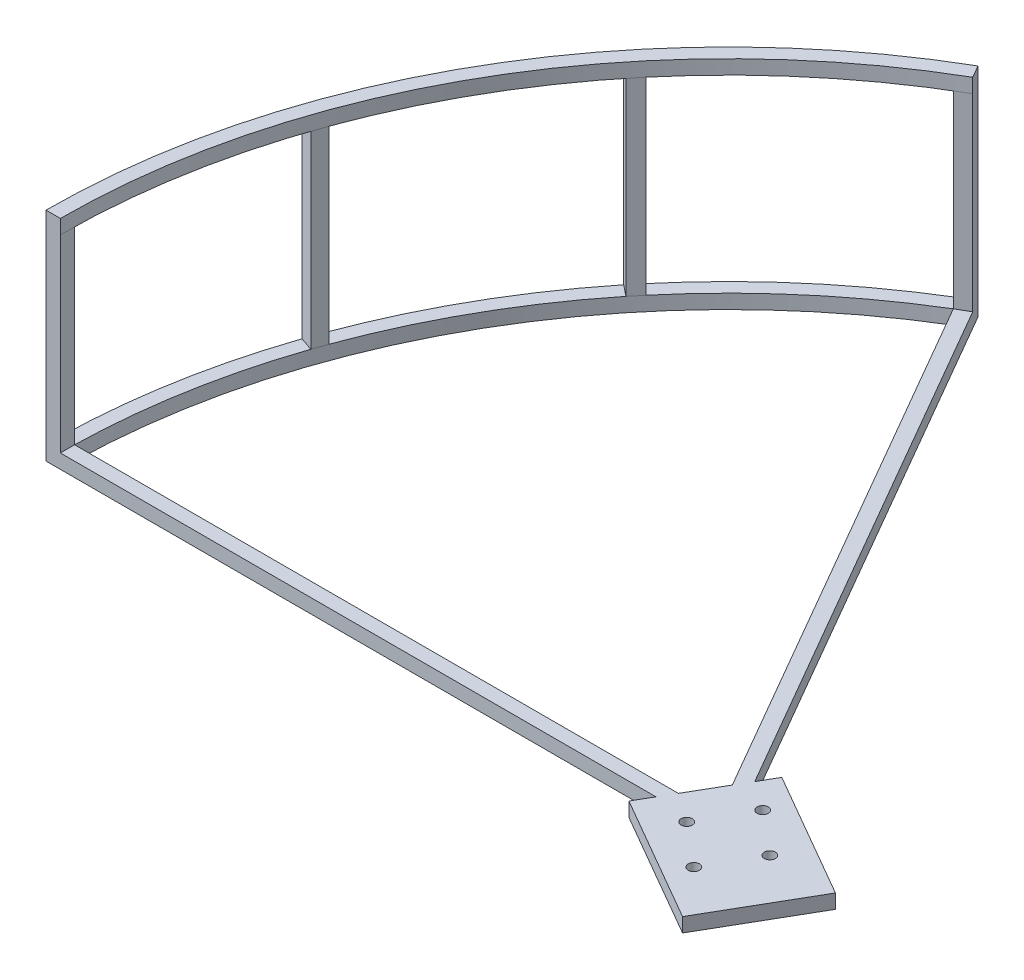
ISO-10303-21;
HEADER;
FILE_DESCRIPTION(('STEP AP214'),'2;1');
FILE_NAME('part.step','',(''),(''),'','','');
FILE_SCHEMA(('AUTOMOTIVE_DESIGN { 1 0 10303 214 1 1 1 1 }'));
ENDSEC;
DATA;
#1=APPLICATION_CONTEXT('core data for automotive mechanical design processes');
#2=APPLICATION_PROTOCOL_DEFINITION('international standard','automotive_design',2000,#1);
#3=PRODUCT_CONTEXT('',#1,'mechanical');
#4=PRODUCT('Part','Part','',(#3));
#5=PRODUCT_RELATED_PRODUCT_CATEGORY('part','',(#4));
#6=PRODUCT_DEFINITION_FORMATION('','',#4);
#7=PRODUCT_DEFINITION_CONTEXT('part definition',#1,'design');
#8=PRODUCT_DEFINITION('design','',#6,#7);
#9=PRODUCT_DEFINITION_SHAPE('','',#8);
#10=(LENGTH_UNIT() NAMED_UNIT(*) SI_UNIT(.MILLI.,.METRE.));
#11=(NAMED_UNIT(*) PLANE_ANGLE_UNIT() SI_UNIT($,.RADIAN.));
#12=(NAMED_UNIT(*) SI_UNIT($,.STERADIAN.) SOLID_ANGLE_UNIT());
#13=UNCERTAINTY_MEASURE_WITH_UNIT(LENGTH_MEASURE(1.E-05),#10,'distance_accuracy_value','');
#14=(GEOMETRIC_REPRESENTATION_CONTEXT(3) GLOBAL_UNCERTAINTY_ASSIGNED_CONTEXT((#13)) GLOBAL_UNIT_ASSIGNED_CONTEXT((#10,
#11,#12)) REPRESENTATION_CONTEXT('',''));
#15=CARTESIAN_POINT('',(0.,0.,0.));
#16=DIRECTION('',(0.,0.,1.));
#17=DIRECTION('',(1.,0.,0.));
#18=AXIS2_PLACEMENT_3D('',#15,#16,#17);
#19=CARTESIAN_POINT('',(3.5610220677106E-12,93.2302238588771,2.05565646575255E-12));
#20=DIRECTION('',(0.,1.,0.));
#21=DIRECTION('',(-1.,0.,0.));
#22=AXIS2_PLACEMENT_3D('',#19,#20,#21);
#23=PLANE('',#22);
#24=CARTESIAN_POINT('',(-161.21365603493,93.2302238588837,-20.462157543148));
#25=DIRECTION('',(0.,1.,0.));
#26=DIRECTION('',(-1.,0.,0.));
#27=AXIS2_PLACEMENT_3D('',#24,#25,#26);
#28=CIRCLE('',#27,152.4);
#29=CARTESIAN_POINT('',(-280.016674298168,93.2302238588904,-115.916873778359));
#30=VERTEX_POINT('',#29);
#31=CARTESIAN_POINT('',(-304.422811442702,93.2302238588903,-72.5860273859827));
#32=VERTEX_POINT('',#31);
#33=EDGE_CURVE('E354',#30,#32,#28,.T.);
#34=ORIENTED_EDGE('',*,*,#33,.T.);
#35=DIRECTION('',(-0.939692620785991,0.,-0.342020143325443));
#36=VECTOR('',#35,1.);
#37=CARTESIAN_POINT('',(-301.407544161036,93.2302238588902,-71.4885598471005));
#38=LINE('',#37,#36);
#39=CARTESIAN_POINT('',(-301.439287371706,93.2302238588902,-71.5001134309243));
#40=VERTEX_POINT('',#39);
#41=EDGE_CURVE('E274',#40,#32,#38,.T.);
#42=ORIENTED_EDGE('',*,*,#41,.F.);
#43=CARTESIAN_POINT('',(-161.21365603493,93.2302238588837,-20.462157543148));
#44=DIRECTION('',(0.,1.,0.));
#45=DIRECTION('',(-1.,0.,0.));
#46=AXIS2_PLACEMENT_3D('',#43,#44,#45);
#47=CIRCLE('',#46,149.225);
#48=CARTESIAN_POINT('',(-277.541611417683,93.2302238588902,-113.928233856793));
#49=VERTEX_POINT('',#48);
#50=EDGE_CURVE('E546',#49,#40,#47,.T.);
#51=ORIENTED_EDGE('',*,*,#50,.F.);
#52=DIRECTION('',(0.779547363932016,0.,0.626343282383267));
#53=VECTOR('',#52,1.);
#54=CARTESIAN_POINT('',(-277.541611417684,93.2302238588902,-113.928233856793));
#55=LINE('',#54,#53);
#56=EDGE_CURVE('E293',#30,#49,#55,.T.);
#57=ORIENTED_EDGE('',*,*,#56,.F.);
#58=EDGE_LOOP('',(#34,#42,#51,#57));
#59=FACE_BOUND('',#58,.T.);
#60=ADVANCED_FACE('F33',(#59),#23,.T.);
#61=CARTESIAN_POINT('',(-302.493458116096,93.2302238588902,-68.5050357761038));
#62=VERTEX_POINT('',#61);
#63=CARTESIAN_POINT('',(-310.404875615709,93.2302238588895,-23.6371575431466));
#64=VERTEX_POINT('',#63);
#65=EDGE_CURVE('E391',#62,#64,#47,.T.);
#66=ORIENTED_EDGE('',*,*,#65,.F.);
#67=DIRECTION('',(0.946756924651818,0.,0.321949259393201));
#68=VECTOR('',#67,1.);
#69=CARTESIAN_POINT('',(-302.493458116096,93.2302238588902,-68.5050357761044));
#70=LINE('',#69,#68);
#71=CARTESIAN_POINT('',(-305.499411351865,93.2302238588903,-69.5272246746779));
#72=VERTEX_POINT('',#71);
#73=EDGE_CURVE('E266',#72,#62,#70,.T.);
#74=ORIENTED_EDGE('',*,*,#73,.F.);
#75=CARTESIAN_POINT('',(-313.579156883385,93.2302238588896,-23.7047107346359));
#76=VERTEX_POINT('',#75);
#77=EDGE_CURVE('E37',#72,#76,#28,.T.);
#78=ORIENTED_EDGE('',*,*,#77,.T.);
#79=DIRECTION('',(-0.999773627614531,0.,-0.021276595744669));
#80=VECTOR('',#79,1.);
#81=CARTESIAN_POINT('',(-310.404875615709,93.2302238588895,-23.6371575431465));
#82=LINE('',#81,#80);
#83=EDGE_CURVE('E321',#64,#76,#82,.T.);
#84=ORIENTED_EDGE('',*,*,#83,.F.);
#85=EDGE_LOOP('',(#66,#74,#78,#84));
#86=FACE_BOUND('',#85,.T.);
#87=ADVANCED_FACE('F421',(#86),#23,.T.);
#88=CARTESIAN_POINT('',(-240.20453989611,93.2302238588896,-150.793275342504));
#89=VERTEX_POINT('',#88);
#90=CARTESIAN_POINT('',(-277.958829166263,93.2302238588903,-118.422989259376));
#91=VERTEX_POINT('',#90);
#92=EDGE_CURVE('E356',#89,#91,#28,.T.);
#93=ORIENTED_EDGE('',*,*,#92,.T.);
#94=DIRECTION('',(-0.766044443119149,0.,-0.642787609686335));
#95=VECTOR('',#94,1.);
#96=CARTESIAN_POINT('',(-275.500760756929,93.2302238588902,-116.360424963696));
#97=LINE('',#96,#95);
#98=CARTESIAN_POINT('',(-275.52663805936,93.2302238588902,-116.382138598622));
#99=VERTEX_POINT('',#98);
#100=EDGE_CURVE('E301',#99,#91,#97,.T.);
#101=ORIENTED_EDGE('',*,*,#100,.F.);
#102=CARTESIAN_POINT('',(-238.558896482336,93.2302238588895,-148.078043721684));
#103=VERTEX_POINT('',#102);
#104=EDGE_CURVE('E397',#103,#99,#47,.T.);
#105=ORIENTED_EDGE('',*,*,#104,.F.);
#106=DIRECTION('',(0.51831288622822,0.,0.85519106167556));
#107=VECTOR('',#106,1.);
#108=CARTESIAN_POINT('',(-238.558896482336,93.2302238588895,-148.078043721684));
#109=LINE('',#108,#107);
#110=EDGE_CURVE('E342',#89,#103,#109,.T.);
#111=ORIENTED_EDGE('',*,*,#110,.F.);
#112=EDGE_LOOP('',(#93,#101,#105,#111));
#113=FACE_BOUND('',#112,.T.);
#114=ADVANCED_FACE('F555',(#113),#23,.T.);
#115=CARTESIAN_POINT('',(-153.337652818122,93.2302238588834,-21.8652161053631));
#116=DIRECTION('',(0.,1.,0.));
#117=DIRECTION('',(-1.,0.,0.));
#118=AXIS2_PLACEMENT_3D('',#115,#116,#117);
#119=CIRCLE('',#118,1.25000000000001);
#120=CARTESIAN_POINT('',(-154.587652818122,93.2302238588835,-21.8652161053631));
#121=VERTEX_POINT('',#120);
#122=EDGE_CURVE('E449',#121,#121,#119,.T.);
#123=ORIENTED_EDGE('',*,*,#122,.F.);
#124=EDGE_LOOP('',(#123));
#125=FACE_BOUND('',#124,.T.);
#126=CARTESIAN_POINT('',(-169.089659251721,93.230223858884,-19.0590989809631));
#127=DIRECTION('',(0.,1.,0.));
#128=DIRECTION('',(-1.,0.,0.));
#129=AXIS2_PLACEMENT_3D('',#126,#127,#128);
#130=CIRCLE('',#129,1.24999999999998);
#131=CARTESIAN_POINT('',(-170.339659251721,93.230223858884,-19.0590989809631));
#132=VERTEX_POINT('',#131);
#133=EDGE_CURVE('E461',#132,#132,#130,.T.);
#134=ORIENTED_EDGE('',*,*,#133,.F.);
#135=EDGE_LOOP('',(#134));
#136=FACE_BOUND('',#135,.T.);
#137=CARTESIAN_POINT('',(-162.879788077534,93.230223858884,-29.8149113631126));
#138=DIRECTION('',(0.,1.,0.));
#139=DIRECTION('',(-1.,0.,0.));
#140=AXIS2_PLACEMENT_3D('',#137,#138,#139);
#141=CIRCLE('',#140,1.25000000000001);
#142=CARTESIAN_POINT('',(-164.129788077534,93.230223858884,-29.8149113631126));
#143=VERTEX_POINT('',#142);
#144=EDGE_CURVE('E455',#143,#143,#141,.T.);
#145=ORIENTED_EDGE('',*,*,#144,.F.);
#146=EDGE_LOOP('',(#145));
#147=FACE_BOUND('',#146,.T.);
#148=CARTESIAN_POINT('',(-159.547523992309,93.2302238588834,-11.1094037232136));
#149=DIRECTION('',(0.,1.,0.));
#150=DIRECTION('',(-1.,0.,0.));
#151=AXIS2_PLACEMENT_3D('',#148,#149,#150);
#152=CIRCLE('',#151,1.24999999999998);
#153=CARTESIAN_POINT('',(-160.797523992309,93.2302238588835,-11.1094037232136));
#154=VERTEX_POINT('',#153);
#155=EDGE_CURVE('E443',#154,#154,#152,.T.);
#156=ORIENTED_EDGE('',*,*,#155,.F.);
#157=EDGE_LOOP('',(#156));
#158=FACE_BOUND('',#157,.T.);
#159=DIRECTION('',(1.,0.,0.));
#160=VECTOR('',#159,1.);
#161=CARTESIAN_POINT('',(-166.712917348961,93.230223858884,-23.6371575431479));
#162=LINE('',#161,#160);
#163=CARTESIAN_POINT('',(-175.527612583814,93.2302238588843,-23.6371575431478));
#164=VERTEX_POINT('',#163);
#165=EDGE_CURVE('E380',#64,#164,#162,.T.);
#166=ORIENTED_EDGE('',*,*,#165,.F.);
#167=DIRECTION('',(0.,0.,-1.));
#168=VECTOR('',#167,1.);
#169=CARTESIAN_POINT('',(-310.404875615709,93.2302238588895,-23.6371575431465));
#170=LINE('',#169,#168);
#171=CARTESIAN_POINT('',(-310.404875615708,93.2302238588894,-20.4621575431466));
#172=VERTEX_POINT('',#171);
#173=EDGE_CURVE('E316',#172,#64,#170,.T.);
#174=ORIENTED_EDGE('',*,*,#173,.F.);
#175=DIRECTION('',(1.,0.,0.));
#176=VECTOR('',#175,1.);
#177=CARTESIAN_POINT('',(-161.21365603493,93.2302238588837,-20.462157543148));
#178=LINE('',#177,#176);
#179=CARTESIAN_POINT('',(-177.360699688492,93.2302238588843,-20.4621575431466));
#180=VERTEX_POINT('',#179);
#181=EDGE_CURVE('E404',#172,#180,#178,.T.);
#182=ORIENTED_EDGE('',*,*,#181,.T.);
#183=DIRECTION('',(-0.5,0.,0.866025403784439));
#184=VECTOR('',#183,1.);
#185=CARTESIAN_POINT('',(-167.073938775092,93.2302238588843,-38.2793500904686));
#186=LINE('',#185,#184);
#187=CARTESIAN_POINT('',(-179.573938775092,93.2302238588843,-16.6287149958576));
#188=VERTEX_POINT('',#187);
#189=EDGE_CURVE('E473',#180,#188,#186,.T.);
#190=ORIENTED_EDGE('',*,*,#189,.T.);
#191=DIRECTION('',(0.866025403784439,0.,0.5));
#192=VECTOR('',#191,1.);
#193=CARTESIAN_POINT('',(-179.573938775092,93.2302238588843,-16.6287149958576));
#194=LINE('',#193,#192);
#195=CARTESIAN_POINT('',(-151.228927309228,93.2302238588829,-0.263714995857651));
#196=VERTEX_POINT('',#195);
#197=EDGE_CURVE('E476',#188,#196,#194,.T.);
#198=ORIENTED_EDGE('',*,*,#197,.T.);
#199=DIRECTION('',(0.5,0.,-0.866025403784438));
#200=VECTOR('',#199,1.);
#201=CARTESIAN_POINT('',(-151.228927309228,93.2302238588829,-0.263714995857651));
#202=LINE('',#201,#200);
#203=CARTESIAN_POINT('',(-138.728927309228,93.2302238588829,-21.9143500904686));
#204=VERTEX_POINT('',#203);
#205=EDGE_CURVE('E467',#196,#204,#202,.T.);
#206=ORIENTED_EDGE('',*,*,#205,.T.);
#207=DIRECTION('',(-0.866025403784439,0.,-0.5));
#208=VECTOR('',#207,1.);
#209=CARTESIAN_POINT('',(-138.728927309228,93.2302238588829,-21.9143500904686));
#210=LINE('',#209,#208);
#211=CARTESIAN_POINT('',(-167.073938775092,93.2302238588843,-38.2793500904686));
#212=VERTEX_POINT('',#211);
#213=EDGE_CURVE('E470',#204,#212,#210,.T.);
#214=ORIENTED_EDGE('',*,*,#213,.T.);
#215=CARTESIAN_POINT('',(-169.287177861711,93.2302238588843,-34.4459075431479));
#216=VERTEX_POINT('',#215);
#217=EDGE_CURVE('E474',#212,#216,#186,.T.);
#218=ORIENTED_EDGE('',*,*,#217,.T.);
#219=DIRECTION('',(-0.500000000000006,0.,-0.866025403784435));
#220=VECTOR('',#219,1.);
#221=CARTESIAN_POINT('',(-161.21365603493,93.2302238588837,-20.462157543148));
#222=LINE('',#221,#220);
#223=CARTESIAN_POINT('',(-235.80926582532,93.2302238588894,-149.665543721684));
#224=VERTEX_POINT('',#223);
#225=EDGE_CURVE('E369',#216,#224,#222,.T.);
#226=ORIENTED_EDGE('',*,*,#225,.T.);
#227=DIRECTION('',(0.866025403784431,0.,-0.500000000000012));
#228=VECTOR('',#227,1.);
#229=CARTESIAN_POINT('',(-238.558896482336,93.2302238588895,-148.078043721684));
#230=LINE('',#229,#228);
#231=EDGE_CURVE('E337',#103,#224,#230,.T.);
#232=ORIENTED_EDGE('',*,*,#231,.F.);
#233=DIRECTION('',(-0.500000000000006,0.,-0.866025403784435));
#234=VECTOR('',#233,1.);
#235=CARTESIAN_POINT('',(-166.712917348961,93.230223858884,-23.6371575431479));
#236=LINE('',#235,#234);
#237=CARTESIAN_POINT('',(-171.120264966388,93.2302238588843,-31.270907543148));
#238=VERTEX_POINT('',#237);
#239=EDGE_CURVE('E384',#238,#103,#236,.T.);
#240=ORIENTED_EDGE('',*,*,#239,.F.);
#241=EDGE_CURVE('E477',#238,#164,#186,.T.);
#242=ORIENTED_EDGE('',*,*,#241,.T.);
#243=EDGE_LOOP('',(#166,#174,#182,#190,#198,#206,#214,#218,#226,#232,#240,#242));
#244=FACE_BOUND('',#243,.T.);
#245=ADVANCED_FACE('F509',(#125,#136,#147,#158,#244),#23,.T.);
#246=CARTESIAN_POINT('',(-167.073938775092,93.2302238588843,-38.2793500904686));
#247=DIRECTION('',(0.866025403784438,0.,0.5));
#248=DIRECTION('',(0.5,0.,-0.866025403784439));
#249=AXIS2_PLACEMENT_3D('',#246,#247,#248);
#250=PLANE('',#249);
#251=DIRECTION('',(0.,-1.,0.));
#252=VECTOR('',#251,1.);
#253=CARTESIAN_POINT('',(-175.527612583814,93.2302238588843,-23.6371575431478));
#254=LINE('',#253,#252);
#255=CARTESIAN_POINT('',(-175.527612583814,90.0552238588843,-23.6371575431479));
#256=VERTEX_POINT('',#255);
#257=EDGE_CURVE('E503',#164,#256,#254,.T.);
#258=ORIENTED_EDGE('',*,*,#257,.F.);
#259=ORIENTED_EDGE('',*,*,#241,.F.);
#260=DIRECTION('',(0.,1.,0.));
#261=VECTOR('',#260,1.);
#262=CARTESIAN_POINT('',(-171.120264966388,93.2302238588843,-31.270907543148));
#263=LINE('',#262,#261);
#264=CARTESIAN_POINT('',(-171.120264966388,90.0552238588843,-31.270907543148));
#265=VERTEX_POINT('',#264);
#266=EDGE_CURVE('E500',#265,#238,#263,.T.);
#267=ORIENTED_EDGE('',*,*,#266,.F.);
#268=DIRECTION('',(-0.5,0.,0.866025403784439));
#269=VECTOR('',#268,1.);
#270=CARTESIAN_POINT('',(-167.073938775092,90.0552238588843,-38.2793500904687));
#271=LINE('',#270,#269);
#272=EDGE_CURVE('E487',#265,#256,#271,.T.);
#273=ORIENTED_EDGE('',*,*,#272,.T.);
#274=EDGE_LOOP('',(#258,#259,#267,#273));
#275=FACE_BOUND('',#274,.T.);
#276=ADVANCED_FACE('F528',(#275),#250,.F.);
#277=ORIENTED_EDGE('',*,*,#189,.F.);
#278=DIRECTION('',(0.,-1.,0.));
#279=VECTOR('',#278,1.);
#280=CARTESIAN_POINT('',(-177.360699688491,93.2302238588843,-20.4621575431478));
#281=LINE('',#280,#279);
#282=CARTESIAN_POINT('',(-177.360699688492,90.0552238588843,-20.4621575431467));
#283=VERTEX_POINT('',#282);
#284=EDGE_CURVE('E11',#180,#283,#281,.T.);
#285=ORIENTED_EDGE('',*,*,#284,.T.);
#286=CARTESIAN_POINT('',(-179.573938775092,90.0552238588843,-16.6287149958577));
#287=VERTEX_POINT('',#286);
#288=EDGE_CURVE('E484',#283,#287,#271,.T.);
#289=ORIENTED_EDGE('',*,*,#288,.T.);
#290=DIRECTION('',(0.,-1.,0.));
#291=VECTOR('',#290,1.);
#292=CARTESIAN_POINT('',(-179.573938775092,93.2302238588843,-16.6287149958576));
#293=LINE('',#292,#291);
#294=EDGE_CURVE('E491',#188,#287,#293,.T.);
#295=ORIENTED_EDGE('',*,*,#294,.F.);
#296=EDGE_LOOP('',(#277,#285,#289,#295));
#297=FACE_BOUND('',#296,.T.);
#298=ADVANCED_FACE('F522',(#297),#250,.F.);
#299=CARTESIAN_POINT('',(3.43911832803088E-12,90.0552238588771,1.98557589246361E-12));
#300=DIRECTION('',(0.,1.,0.));
#301=DIRECTION('',(-1.,0.,0.));
#302=AXIS2_PLACEMENT_3D('',#299,#300,#301);
#303=PLANE('',#302);
#304=ORIENTED_EDGE('',*,*,#288,.F.);
#305=DIRECTION('',(1.,0.,0.));
#306=VECTOR('',#305,1.);
#307=CARTESIAN_POINT('',(-161.21365603493,90.0552238588837,-20.462157543148));
#308=LINE('',#307,#306);
#309=CARTESIAN_POINT('',(-313.61365603493,90.0552238588895,-20.4621575431467));
#310=VERTEX_POINT('',#309);
#311=EDGE_CURVE('E368',#310,#283,#308,.T.);
#312=ORIENTED_EDGE('',*,*,#311,.F.);
#313=CARTESIAN_POINT('',(-161.21365603493,90.0552238588837,-20.462157543148));
#314=DIRECTION('',(0.,1.,0.));
#315=DIRECTION('',(-1.,0.,0.));
#316=AXIS2_PLACEMENT_3D('',#313,#314,#315);
#317=CIRCLE('',#316,152.4);
#318=CARTESIAN_POINT('',(-237.413656034931,90.0552238588895,-152.444429079896));
#319=VERTEX_POINT('',#318);
#320=EDGE_CURVE('E222',#319,#310,#317,.T.);
#321=ORIENTED_EDGE('',*,*,#320,.F.);
#322=DIRECTION('',(-0.500000000000006,0.,-0.866025403784435));
#323=VECTOR('',#322,1.);
#324=CARTESIAN_POINT('',(-161.21365603493,90.0552238588837,-20.462157543148));
#325=LINE('',#324,#323);
#326=CARTESIAN_POINT('',(-169.287177861711,90.0552238588843,-34.445907543148));
#327=VERTEX_POINT('',#326);
#328=EDGE_CURVE('E409',#327,#319,#325,.T.);
#329=ORIENTED_EDGE('',*,*,#328,.F.);
#330=CARTESIAN_POINT('',(-167.073938775092,90.0552238588843,-38.2793500904687));
#331=VERTEX_POINT('',#330);
#332=EDGE_CURVE('E485',#331,#327,#271,.T.);
#333=ORIENTED_EDGE('',*,*,#332,.F.);
#334=DIRECTION('',(-0.866025403784439,0.,-0.5));
#335=VECTOR('',#334,1.);
#336=CARTESIAN_POINT('',(-138.728927309228,90.0552238588829,-21.9143500904687));
#337=LINE('',#336,#335);
#338=CARTESIAN_POINT('',(-138.728927309228,90.0552238588829,-21.9143500904687));
#339=VERTEX_POINT('',#338);
#340=EDGE_CURVE('E482',#339,#331,#337,.T.);
#341=ORIENTED_EDGE('',*,*,#340,.F.);
#342=DIRECTION('',(0.5,0.,-0.866025403784438));
#343=VECTOR('',#342,1.);
#344=CARTESIAN_POINT('',(-151.228927309228,90.0552238588829,-0.263714995857721));
#345=LINE('',#344,#343);
#346=CARTESIAN_POINT('',(-151.228927309228,90.0552238588829,-0.263714995857721));
#347=VERTEX_POINT('',#346);
#348=EDGE_CURVE('E464',#347,#339,#345,.T.);
#349=ORIENTED_EDGE('',*,*,#348,.F.);
#350=DIRECTION('',(0.866025403784439,0.,0.5));
#351=VECTOR('',#350,1.);
#352=CARTESIAN_POINT('',(-179.573938775092,90.0552238588843,-16.6287149958577));
#353=LINE('',#352,#351);
#354=EDGE_CURVE('E471',#287,#347,#353,.T.);
#355=ORIENTED_EDGE('',*,*,#354,.F.);
#356=EDGE_LOOP('',(#304,#312,#321,#329,#333,#341,#349,#355));
#357=FACE_BOUND('',#356,.T.);
#358=CARTESIAN_POINT('',(-169.089659251721,90.055223858884,-19.0590989809632));
#359=DIRECTION('',(0.,1.,0.));
#360=DIRECTION('',(-1.,0.,0.));
#361=AXIS2_PLACEMENT_3D('',#358,#359,#360);
#362=CIRCLE('',#361,1.24999999999998);
#363=CARTESIAN_POINT('',(-170.339659251721,90.055223858884,-19.0590989809632));
#364=VERTEX_POINT('',#363);
#365=EDGE_CURVE('E458',#364,#364,#362,.T.);
#366=ORIENTED_EDGE('',*,*,#365,.T.);
#367=EDGE_LOOP('',(#366));
#368=FACE_BOUND('',#367,.T.);
#369=CARTESIAN_POINT('',(-162.879788077534,90.055223858884,-29.8149113631127));
#370=DIRECTION('',(0.,1.,0.));
#371=DIRECTION('',(-1.,0.,0.));
#372=AXIS2_PLACEMENT_3D('',#369,#370,#371);
#373=CIRCLE('',#372,1.25000000000001);
#374=CARTESIAN_POINT('',(-164.129788077534,90.055223858884,-29.8149113631127));
#375=VERTEX_POINT('',#374);
#376=EDGE_CURVE('E452',#375,#375,#373,.T.);
#377=ORIENTED_EDGE('',*,*,#376,.T.);
#378=EDGE_LOOP('',(#377));
#379=FACE_BOUND('',#378,.T.);
#380=CARTESIAN_POINT('',(-153.337652818122,90.0552238588834,-21.8652161053632));
#381=DIRECTION('',(0.,1.,0.));
#382=DIRECTION('',(-1.,0.,0.));
#383=AXIS2_PLACEMENT_3D('',#380,#381,#382);
#384=CIRCLE('',#383,1.25000000000001);
#385=CARTESIAN_POINT('',(-154.587652818122,90.0552238588835,-21.8652161053632));
#386=VERTEX_POINT('',#385);
#387=EDGE_CURVE('E446',#386,#386,#384,.T.);
#388=ORIENTED_EDGE('',*,*,#387,.T.);
#389=EDGE_LOOP('',(#388));
#390=FACE_BOUND('',#389,.T.);
#391=CARTESIAN_POINT('',(-159.547523992309,90.0552238588834,-11.1094037232137));
#392=DIRECTION('',(0.,1.,0.));
#393=DIRECTION('',(-1.,0.,0.));
#394=AXIS2_PLACEMENT_3D('',#391,#392,#393);
#395=CIRCLE('',#394,1.24999999999998);
#396=CARTESIAN_POINT('',(-160.797523992309,90.0552238588835,-11.1094037232137));
#397=VERTEX_POINT('',#396);
#398=EDGE_CURVE('E226',#397,#397,#395,.T.);
#399=ORIENTED_EDGE('',*,*,#398,.T.);
#400=EDGE_LOOP('',(#399));
#401=FACE_BOUND('',#400,.T.);
#402=DIRECTION('',(1.,0.,0.));
#403=VECTOR('',#402,1.);
#404=CARTESIAN_POINT('',(-166.712917348962,90.055223858884,-23.637157543148));
#405=LINE('',#404,#403);
#406=CARTESIAN_POINT('',(-310.404875615709,90.0552238588895,-23.6371575431467));
#407=VERTEX_POINT('',#406);
#408=EDGE_CURVE('E400',#407,#256,#405,.T.);
#409=ORIENTED_EDGE('',*,*,#408,.T.);
#410=ORIENTED_EDGE('',*,*,#272,.F.);
#411=DIRECTION('',(-0.500000000000006,0.,-0.866025403784435));
#412=VECTOR('',#411,1.);
#413=CARTESIAN_POINT('',(-166.712917348962,90.055223858884,-23.637157543148));
#414=LINE('',#413,#412);
#415=CARTESIAN_POINT('',(-238.558896482336,90.0552238588895,-148.078043721684));
#416=VERTEX_POINT('',#415);
#417=EDGE_CURVE('E534',#265,#416,#414,.T.);
#418=ORIENTED_EDGE('',*,*,#417,.T.);
#419=CARTESIAN_POINT('',(-161.21365603493,90.0552238588837,-20.462157543148));
#420=DIRECTION('',(0.,1.,0.));
#421=DIRECTION('',(-1.,0.,0.));
#422=AXIS2_PLACEMENT_3D('',#419,#420,#421);
#423=CIRCLE('',#422,149.225);
#424=EDGE_CURVE('E394',#416,#407,#423,.T.);
#425=ORIENTED_EDGE('',*,*,#424,.T.);
#426=EDGE_LOOP('',(#409,#410,#418,#425));
#427=FACE_BOUND('',#426,.T.);
#428=ADVANCED_FACE('F517',(#357,#368,#379,#390,#401,#427),#303,.F.);
#429=CARTESIAN_POINT('',(-151.228927309228,93.2302238588829,-0.263714995857651));
#430=DIRECTION('',(-0.866025403784438,0.,-0.5));
#431=DIRECTION('',(-0.5,0.,0.866025403784439));
#432=AXIS2_PLACEMENT_3D('',#429,#430,#431);
#433=PLANE('',#432);
#434=ORIENTED_EDGE('',*,*,#348,.T.);
#435=DIRECTION('',(0.,-1.,0.));
#436=VECTOR('',#435,1.);
#437=CARTESIAN_POINT('',(-138.728927309228,93.2302238588829,-21.9143500904686));
#438=LINE('',#437,#436);
#439=EDGE_CURVE('E497',#204,#339,#438,.T.);
#440=ORIENTED_EDGE('',*,*,#439,.F.);
#441=ORIENTED_EDGE('',*,*,#205,.F.);
#442=DIRECTION('',(0.,-1.,0.));
#443=VECTOR('',#442,1.);
#444=CARTESIAN_POINT('',(-151.228927309228,93.2302238588829,-0.263714995857651));
#445=LINE('',#444,#443);
#446=EDGE_CURVE('E479',#196,#347,#445,.T.);
#447=ORIENTED_EDGE('',*,*,#446,.T.);
#448=EDGE_LOOP('',(#434,#440,#441,#447));
#449=FACE_BOUND('',#448,.T.);
#450=ADVANCED_FACE('F35',(#449),#433,.F.);
#451=CARTESIAN_POINT('',(-138.728927309228,93.2302238588829,-21.9143500904686));
#452=DIRECTION('',(-0.5,0.,0.866025403784439));
#453=DIRECTION('',(0.866025403784439,0.,0.5));
#454=AXIS2_PLACEMENT_3D('',#451,#452,#453);
#455=PLANE('',#454);
#456=ORIENTED_EDGE('',*,*,#340,.T.);
#457=DIRECTION('',(0.,-1.,0.));
#458=VECTOR('',#457,1.);
#459=CARTESIAN_POINT('',(-167.073938775092,93.2302238588843,-38.2793500904686));
#460=LINE('',#459,#458);
#461=EDGE_CURVE('E494',#212,#331,#460,.T.);
#462=ORIENTED_EDGE('',*,*,#461,.F.);
#463=ORIENTED_EDGE('',*,*,#213,.F.);
#464=ORIENTED_EDGE('',*,*,#439,.T.);
#465=EDGE_LOOP('',(#456,#462,#463,#464));
#466=FACE_BOUND('',#465,.T.);
#467=ADVANCED_FACE('F514',(#466),#455,.F.);
#468=ORIENTED_EDGE('',*,*,#332,.T.);
#469=DIRECTION('',(0.,1.,0.));
#470=VECTOR('',#469,1.);
#471=CARTESIAN_POINT('',(-169.287177861711,93.2302238588843,-34.445907543148));
#472=LINE('',#471,#470);
#473=EDGE_CURVE('E43',#327,#216,#472,.T.);
#474=ORIENTED_EDGE('',*,*,#473,.T.);
#475=ORIENTED_EDGE('',*,*,#217,.F.);
#476=ORIENTED_EDGE('',*,*,#461,.T.);
#477=EDGE_LOOP('',(#468,#474,#475,#476));
#478=FACE_BOUND('',#477,.T.);
#479=ADVANCED_FACE('F507',(#478),#250,.F.);
#480=CARTESIAN_POINT('',(-179.573938775092,93.2302238588843,-16.6287149958576));
#481=DIRECTION('',(0.5,0.,-0.866025403784439));
#482=DIRECTION('',(-0.866025403784439,0.,-0.5));
#483=AXIS2_PLACEMENT_3D('',#480,#481,#482);
#484=PLANE('',#483);
#485=ORIENTED_EDGE('',*,*,#354,.T.);
#486=ORIENTED_EDGE('',*,*,#446,.F.);
#487=ORIENTED_EDGE('',*,*,#197,.F.);
#488=ORIENTED_EDGE('',*,*,#294,.T.);
#489=EDGE_LOOP('',(#485,#486,#487,#488));
#490=FACE_BOUND('',#489,.T.);
#491=ADVANCED_FACE('F628',(#490),#484,.F.);
#492=CARTESIAN_POINT('',(-169.089659251721,93.230223858884,-19.0590989809631));
#493=DIRECTION('',(0.,-1.,0.));
#494=DIRECTION('',(1.,0.,0.));
#495=AXIS2_PLACEMENT_3D('',#492,#493,#494);
#496=CYLINDRICAL_SURFACE('',#495,1.24999999999998);
#497=ORIENTED_EDGE('',*,*,#133,.T.);
#498=EDGE_LOOP('',(#497));
#499=FACE_BOUND('',#498,.T.);
#500=ORIENTED_EDGE('',*,*,#365,.F.);
#501=EDGE_LOOP('',(#500));
#502=FACE_BOUND('',#501,.T.);
#503=ADVANCED_FACE('F630',(#499,#502),#496,.F.);
#504=CARTESIAN_POINT('',(-162.879788077534,93.230223858884,-29.8149113631126));
#505=DIRECTION('',(0.,-1.,0.));
#506=DIRECTION('',(1.,0.,0.));
#507=AXIS2_PLACEMENT_3D('',#504,#505,#506);
#508=CYLINDRICAL_SURFACE('',#507,1.25000000000001);
#509=ORIENTED_EDGE('',*,*,#144,.T.);
#510=EDGE_LOOP('',(#509));
#511=FACE_BOUND('',#510,.T.);
#512=ORIENTED_EDGE('',*,*,#376,.F.);
#513=EDGE_LOOP('',(#512));
#514=FACE_BOUND('',#513,.T.);
#515=ADVANCED_FACE('F653',(#511,#514),#508,.F.);
#516=CARTESIAN_POINT('',(-153.337652818122,93.2302238588834,-21.8652161053631));
#517=DIRECTION('',(0.,-1.,0.));
#518=DIRECTION('',(1.,0.,0.));
#519=AXIS2_PLACEMENT_3D('',#516,#517,#518);
#520=CYLINDRICAL_SURFACE('',#519,1.25000000000001);
#521=ORIENTED_EDGE('',*,*,#122,.T.);
#522=EDGE_LOOP('',(#521));
#523=FACE_BOUND('',#522,.T.);
#524=ORIENTED_EDGE('',*,*,#387,.F.);
#525=EDGE_LOOP('',(#524));
#526=FACE_BOUND('',#525,.T.);
#527=ADVANCED_FACE('F617',(#523,#526),#520,.F.);
#528=CARTESIAN_POINT('',(-159.547523992309,93.2302238588834,-11.1094037232136));
#529=DIRECTION('',(0.,-1.,0.));
#530=DIRECTION('',(1.,0.,0.));
#531=AXIS2_PLACEMENT_3D('',#528,#529,#530);
#532=CYLINDRICAL_SURFACE('',#531,1.24999999999998);
#533=ORIENTED_EDGE('',*,*,#155,.T.);
#534=EDGE_LOOP('',(#533));
#535=FACE_BOUND('',#534,.T.);
#536=ORIENTED_EDGE('',*,*,#398,.F.);
#537=EDGE_LOOP('',(#536));
#538=FACE_BOUND('',#537,.T.);
#539=ADVANCED_FACE('F614',(#535,#538),#532,.F.);
#540=CARTESIAN_POINT('',(-161.21365603493,90.0552238588837,-20.462157543148));
#541=DIRECTION('',(0.,0.,1.));
#542=DIRECTION('',(0.,-1.,0.));
#543=AXIS2_PLACEMENT_3D('',#540,#541,#542);
#544=PLANE('',#543);
#545=ORIENTED_EDGE('',*,*,#284,.F.);
#546=ORIENTED_EDGE('',*,*,#181,.F.);
#547=DIRECTION('',(0.,-1.,0.));
#548=VECTOR('',#547,1.);
#549=CARTESIAN_POINT('',(-310.404875615707,135.430223858889,-20.4621575431448));
#550=LINE('',#549,#548);
#551=CARTESIAN_POINT('',(-310.404875615707,135.430223858889,-20.4621575431448));
#552=VERTEX_POINT('',#551);
#553=EDGE_CURVE('E334',#552,#172,#550,.T.);
#554=ORIENTED_EDGE('',*,*,#553,.F.);
#555=DIRECTION('',(0.,-1.,0.));
#556=VECTOR('',#555,1.);
#557=CARTESIAN_POINT('',(-310.404875615707,138.605223858889,-20.4621575431448));
#558=LINE('',#557,#556);
#559=CARTESIAN_POINT('',(-310.404875615707,138.605223858889,-20.4621575431448));
#560=VERTEX_POINT('',#559);
#561=EDGE_CURVE('E235',#560,#552,#558,.T.);
#562=ORIENTED_EDGE('',*,*,#561,.F.);
#563=DIRECTION('',(1.,0.,2.63821435460509E-13));
#564=VECTOR('',#563,1.);
#565=CARTESIAN_POINT('',(-313.613656034929,138.60522385889,-20.4621575431456));
#566=LINE('',#565,#564);
#567=CARTESIAN_POINT('',(-313.613656034929,138.60522385889,-20.4621575431456));
#568=VERTEX_POINT('',#567);
#569=EDGE_CURVE('E230',#568,#560,#566,.T.);
#570=ORIENTED_EDGE('',*,*,#569,.F.);
#571=DIRECTION('',(0.,1.,0.));
#572=VECTOR('',#571,1.);
#573=CARTESIAN_POINT('',(-313.61365603493,90.0552238588895,-20.4621575431467));
#574=LINE('',#573,#572);
#575=EDGE_CURVE('E214',#310,#568,#574,.T.);
#576=ORIENTED_EDGE('',*,*,#575,.F.);
#577=ORIENTED_EDGE('',*,*,#311,.T.);
#578=EDGE_LOOP('',(#545,#546,#554,#562,#570,#576,#577));
#579=FACE_BOUND('',#578,.T.);
#580=ADVANCED_FACE('F232',(#579),#544,.T.);
#581=CARTESIAN_POINT('',(-161.21365603493,90.0552238588837,-20.462157543148));
#582=DIRECTION('',(0.866025403784435,0.,-0.500000000000006));
#583=DIRECTION('',(-0.500000000000006,0.,-0.866025403784435));
#584=AXIS2_PLACEMENT_3D('',#581,#582,#583);
#585=PLANE('',#584);
#586=ORIENTED_EDGE('',*,*,#473,.F.);
#587=ORIENTED_EDGE('',*,*,#328,.T.);
#588=DIRECTION('',(0.,1.,0.));
#589=VECTOR('',#588,1.);
#590=CARTESIAN_POINT('',(-237.413656034931,90.0552238588895,-152.444429079896));
#591=LINE('',#590,#589);
#592=CARTESIAN_POINT('',(-237.413656034929,138.60522385889,-152.444429079895));
#593=VERTEX_POINT('',#592);
#594=EDGE_CURVE('E227',#319,#593,#591,.T.);
#595=ORIENTED_EDGE('',*,*,#594,.T.);
#596=DIRECTION('',(-0.500000000000004,0.,-0.866025403784436));
#597=VECTOR('',#596,1.);
#598=CARTESIAN_POINT('',(-237.413656034929,138.60522385889,-152.444429079895));
#599=LINE('',#598,#597);
#600=CARTESIAN_POINT('',(-235.809265825318,138.605223858889,-149.665543721683));
#601=VERTEX_POINT('',#600);
#602=EDGE_CURVE('E243',#601,#593,#599,.T.);
#603=ORIENTED_EDGE('',*,*,#602,.F.);
#604=DIRECTION('',(0.,-1.,0.));
#605=VECTOR('',#604,1.);
#606=CARTESIAN_POINT('',(-235.809265825318,138.605223858889,-149.665543721683));
#607=LINE('',#606,#605);
#608=CARTESIAN_POINT('',(-235.809265825319,135.430223858889,-149.665543721683));
#609=VERTEX_POINT('',#608);
#610=EDGE_CURVE('E253',#601,#609,#607,.T.);
#611=ORIENTED_EDGE('',*,*,#610,.T.);
#612=DIRECTION('',(0.,-1.,0.));
#613=VECTOR('',#612,1.);
#614=CARTESIAN_POINT('',(-235.809265825319,135.430223858889,-149.665543721683));
#615=LINE('',#614,#613);
#616=EDGE_CURVE('E377',#609,#224,#615,.T.);
#617=ORIENTED_EDGE('',*,*,#616,.T.);
#618=ORIENTED_EDGE('',*,*,#225,.F.);
#619=EDGE_LOOP('',(#586,#587,#595,#603,#611,#617,#618));
#620=FACE_BOUND('',#619,.T.);
#621=ADVANCED_FACE('F440',(#620),#585,.T.);
#622=CARTESIAN_POINT('',(-166.712917348962,90.055223858884,-23.637157543148));
#623=DIRECTION('',(0.,0.,1.));
#624=DIRECTION('',(0.,-1.,0.));
#625=AXIS2_PLACEMENT_3D('',#622,#623,#624);
#626=PLANE('',#625);
#627=ORIENTED_EDGE('',*,*,#165,.T.);
#628=ORIENTED_EDGE('',*,*,#257,.T.);
#629=ORIENTED_EDGE('',*,*,#408,.F.);
#630=DIRECTION('',(0.,1.,0.));
#631=VECTOR('',#630,1.);
#632=CARTESIAN_POINT('',(-310.404875615709,90.0552238588895,-23.6371575431467));
#633=LINE('',#632,#631);
#634=EDGE_CURVE('E402',#407,#64,#633,.T.);
#635=ORIENTED_EDGE('',*,*,#634,.T.);
#636=EDGE_LOOP('',(#627,#628,#629,#635));
#637=FACE_BOUND('',#636,.T.);
#638=ADVANCED_FACE('F540',(#637),#626,.F.);
#639=CARTESIAN_POINT('',(-166.712917348962,90.055223858884,-23.637157543148));
#640=DIRECTION('',(0.866025403784435,0.,-0.500000000000006));
#641=DIRECTION('',(-0.500000000000006,0.,-0.866025403784435));
#642=AXIS2_PLACEMENT_3D('',#639,#640,#641);
#643=PLANE('',#642);
#644=ORIENTED_EDGE('',*,*,#417,.F.);
#645=ORIENTED_EDGE('',*,*,#266,.T.);
#646=ORIENTED_EDGE('',*,*,#239,.T.);
#647=DIRECTION('',(0.,1.,0.));
#648=VECTOR('',#647,1.);
#649=CARTESIAN_POINT('',(-238.558896482336,90.0552238588895,-148.078043721684));
#650=LINE('',#649,#648);
#651=EDGE_CURVE('E405',#416,#103,#650,.T.);
#652=ORIENTED_EDGE('',*,*,#651,.F.);
#653=EDGE_LOOP('',(#644,#645,#646,#652));
#654=FACE_BOUND('',#653,.T.);
#655=ADVANCED_FACE('F532',(#654),#643,.F.);
#656=CARTESIAN_POINT('',(-161.21365603493,90.0552238588837,-20.462157543148));
#657=DIRECTION('',(0.,1.,0.));
#658=DIRECTION('',(-1.,0.,0.));
#659=AXIS2_PLACEMENT_3D('',#656,#657,#658);
#660=CYLINDRICAL_SURFACE('',#659,152.4);
#661=DIRECTION('',(0.,-1.,0.));
#662=VECTOR('',#661,1.);
#663=CARTESIAN_POINT('',(-240.204539896109,135.43022385889,-150.793275342503));
#664=LINE('',#663,#662);
#665=CARTESIAN_POINT('',(-240.204539896109,135.43022385889,-150.793275342503));
#666=VERTEX_POINT('',#665);
#667=EDGE_CURVE('E374',#666,#89,#664,.T.);
#668=ORIENTED_EDGE('',*,*,#667,.F.);
#669=CARTESIAN_POINT('',(-161.213656034929,135.430223858884,-20.4621575431468));
#670=DIRECTION('',(0.,1.,0.));
#671=DIRECTION('',(1.,0.,0.));
#672=AXIS2_PLACEMENT_3D('',#669,#670,#671);
#673=CIRCLE('',#672,152.4);
#674=CARTESIAN_POINT('',(-277.958829166262,135.43022385889,-118.422989259375));
#675=VERTEX_POINT('',#674);
#676=EDGE_CURVE('E257',#666,#675,#673,.T.);
#677=ORIENTED_EDGE('',*,*,#676,.T.);
#678=DIRECTION('',(0.,-1.,0.));
#679=VECTOR('',#678,1.);
#680=CARTESIAN_POINT('',(-277.958829166262,135.43022385889,-118.422989259375));
#681=LINE('',#680,#679);
#682=EDGE_CURVE('E310',#675,#91,#681,.T.);
#683=ORIENTED_EDGE('',*,*,#682,.T.);
#684=ORIENTED_EDGE('',*,*,#92,.F.);
#685=EDGE_LOOP('',(#668,#677,#683,#684));
#686=FACE_BOUND('',#685,.T.);
#687=ORIENTED_EDGE('',*,*,#575,.T.);
#688=CARTESIAN_POINT('',(-161.213656034929,138.605223858884,-20.4621575431467));
#689=DIRECTION('',(0.,1.,0.));
#690=DIRECTION('',(1.,0.,0.));
#691=AXIS2_PLACEMENT_3D('',#688,#689,#690);
#692=CIRCLE('',#691,152.4);
#693=EDGE_CURVE('E220',#593,#568,#692,.T.);
#694=ORIENTED_EDGE('',*,*,#693,.F.);
#695=ORIENTED_EDGE('',*,*,#594,.F.);
#696=ORIENTED_EDGE('',*,*,#320,.T.);
#697=EDGE_LOOP('',(#687,#694,#695,#696));
#698=FACE_BOUND('',#697,.T.);
#699=DIRECTION('',(0.,-1.,0.));
#700=VECTOR('',#699,1.);
#701=CARTESIAN_POINT('',(-280.016674298167,135.43022385889,-115.916873778358));
#702=LINE('',#701,#700);
#703=CARTESIAN_POINT('',(-280.016674298167,135.43022385889,-115.916873778358));
#704=VERTEX_POINT('',#703);
#705=EDGE_CURVE('E308',#704,#30,#702,.T.);
#706=ORIENTED_EDGE('',*,*,#705,.F.);
#707=CARTESIAN_POINT('',(-304.4228114427,135.43022385889,-72.5860273859817));
#708=VERTEX_POINT('',#707);
#709=EDGE_CURVE('E256',#704,#708,#673,.T.);
#710=ORIENTED_EDGE('',*,*,#709,.T.);
#711=DIRECTION('',(0.,-1.,0.));
#712=VECTOR('',#711,1.);
#713=CARTESIAN_POINT('',(-304.4228114427,135.43022385889,-72.5860273859817));
#714=LINE('',#713,#712);
#715=EDGE_CURVE('E283',#708,#32,#714,.T.);
#716=ORIENTED_EDGE('',*,*,#715,.T.);
#717=ORIENTED_EDGE('',*,*,#33,.F.);
#718=EDGE_LOOP('',(#706,#710,#716,#717));
#719=FACE_BOUND('',#718,.T.);
#720=CARTESIAN_POINT('',(-305.499411351864,135.43022385889,-69.5272246746769));
#721=VERTEX_POINT('',#720);
#722=CARTESIAN_POINT('',(-313.579156883383,135.43022385889,-23.7047107346349));
#723=VERTEX_POINT('',#722);
#724=EDGE_CURVE('E254',#721,#723,#673,.T.);
#725=ORIENTED_EDGE('',*,*,#724,.T.);
#726=DIRECTION('',(0.,-1.,0.));
#727=VECTOR('',#726,1.);
#728=CARTESIAN_POINT('',(-313.579156883383,135.43022385889,-23.7047107346349));
#729=LINE('',#728,#727);
#730=EDGE_CURVE('E324',#723,#76,#729,.T.);
#731=ORIENTED_EDGE('',*,*,#730,.T.);
#732=ORIENTED_EDGE('',*,*,#77,.F.);
#733=DIRECTION('',(0.,-1.,0.));
#734=VECTOR('',#733,1.);
#735=CARTESIAN_POINT('',(-305.499411351864,135.43022385889,-69.5272246746769));
#736=LINE('',#735,#734);
#737=EDGE_CURVE('E281',#721,#72,#736,.T.);
#738=ORIENTED_EDGE('',*,*,#737,.F.);
#739=EDGE_LOOP('',(#725,#731,#732,#738));
#740=FACE_BOUND('',#739,.T.);
#741=ADVANCED_FACE('F216',(#686,#698,#719,#740),#660,.T.);
#742=CARTESIAN_POINT('',(-161.21365603493,90.0552238588837,-20.462157543148));
#743=DIRECTION('',(0.,1.,0.));
#744=DIRECTION('',(-1.,0.,0.));
#745=AXIS2_PLACEMENT_3D('',#742,#743,#744);
#746=CYLINDRICAL_SURFACE('',#745,149.225);
#747=ORIENTED_EDGE('',*,*,#104,.T.);
#748=EDGE_CURVE('E401',#99,#49,#47,.T.);
#749=ORIENTED_EDGE('',*,*,#748,.T.);
#750=ORIENTED_EDGE('',*,*,#50,.T.);
#751=EDGE_CURVE('E545',#40,#62,#47,.T.);
#752=ORIENTED_EDGE('',*,*,#751,.T.);
#753=ORIENTED_EDGE('',*,*,#65,.T.);
#754=ORIENTED_EDGE('',*,*,#634,.F.);
#755=ORIENTED_EDGE('',*,*,#424,.F.);
#756=ORIENTED_EDGE('',*,*,#651,.T.);
#757=EDGE_LOOP('',(#747,#749,#750,#752,#753,#754,#755,#756));
#758=FACE_BOUND('',#757,.T.);
#759=ADVANCED_FACE('F542',(#758),#746,.F.);
#760=CARTESIAN_POINT('',(-238.558896482334,135.430223858889,-148.078043721683));
#761=DIRECTION('',(-0.500000000000012,0.,-0.866025403784431));
#762=DIRECTION('',(-0.866025403784432,0.,0.500000000000012));
#763=AXIS2_PLACEMENT_3D('',#760,#761,#762);
#764=PLANE('',#763);
#765=ORIENTED_EDGE('',*,*,#231,.T.);
#766=ORIENTED_EDGE('',*,*,#616,.F.);
#767=DIRECTION('',(0.866025403784431,0.,-0.500000000000012));
#768=VECTOR('',#767,1.);
#769=CARTESIAN_POINT('',(-238.558896482334,135.430223858889,-148.078043721683));
#770=LINE('',#769,#768);
#771=CARTESIAN_POINT('',(-238.558896482334,135.430223858889,-148.078043721683));
#772=VERTEX_POINT('',#771);
#773=EDGE_CURVE('E338',#772,#609,#770,.T.);
#774=ORIENTED_EDGE('',*,*,#773,.F.);
#775=DIRECTION('',(0.,-1.,0.));
#776=VECTOR('',#775,1.);
#777=CARTESIAN_POINT('',(-238.558896482334,135.430223858889,-148.078043721683));
#778=LINE('',#777,#776);
#779=EDGE_CURVE('E345',#772,#103,#778,.T.);
#780=ORIENTED_EDGE('',*,*,#779,.T.);
#781=EDGE_LOOP('',(#765,#766,#774,#780));
#782=FACE_BOUND('',#781,.T.);
#783=ADVANCED_FACE('F710',(#782),#764,.F.);
#784=CARTESIAN_POINT('',(-238.558896482334,135.430223858889,-148.078043721683));
#785=DIRECTION('',(0.855191061675561,0.,-0.51831288622822));
#786=DIRECTION('',(-0.51831288622822,0.,-0.855191061675561));
#787=AXIS2_PLACEMENT_3D('',#784,#785,#786);
#788=PLANE('',#787);
#789=ORIENTED_EDGE('',*,*,#110,.T.);
#790=ORIENTED_EDGE('',*,*,#779,.F.);
#791=DIRECTION('',(0.51831288622822,0.,0.85519106167556));
#792=VECTOR('',#791,1.);
#793=CARTESIAN_POINT('',(-238.558896482334,135.430223858889,-148.078043721683));
#794=LINE('',#793,#792);
#795=EDGE_CURVE('E341',#666,#772,#794,.T.);
#796=ORIENTED_EDGE('',*,*,#795,.F.);
#797=ORIENTED_EDGE('',*,*,#667,.T.);
#798=EDGE_LOOP('',(#789,#790,#796,#797));
#799=FACE_BOUND('',#798,.T.);
#800=ADVANCED_FACE('F561',(#799),#788,.F.);
#801=CARTESIAN_POINT('',(-310.404875615707,135.430223858889,-23.6371575431456));
#802=DIRECTION('',(-1.,0.,0.));
#803=DIRECTION('',(0.,0.,1.));
#804=AXIS2_PLACEMENT_3D('',#801,#802,#803);
#805=PLANE('',#804);
#806=ORIENTED_EDGE('',*,*,#173,.T.);
#807=DIRECTION('',(0.,-1.,0.));
#808=VECTOR('',#807,1.);
#809=CARTESIAN_POINT('',(-310.404875615707,135.430223858889,-23.6371575431456));
#810=LINE('',#809,#808);
#811=CARTESIAN_POINT('',(-310.404875615707,135.430223858889,-23.6371575431456));
#812=VERTEX_POINT('',#811);
#813=EDGE_CURVE('E331',#812,#64,#810,.T.);
#814=ORIENTED_EDGE('',*,*,#813,.F.);
#815=DIRECTION('',(0.,0.,-1.));
#816=VECTOR('',#815,1.);
#817=CARTESIAN_POINT('',(-310.404875615707,135.430223858889,-23.6371575431456));
#818=LINE('',#817,#816);
#819=EDGE_CURVE('E317',#552,#812,#818,.T.);
#820=ORIENTED_EDGE('',*,*,#819,.F.);
#821=ORIENTED_EDGE('',*,*,#553,.T.);
#822=EDGE_LOOP('',(#806,#814,#820,#821));
#823=FACE_BOUND('',#822,.T.);
#824=ADVANCED_FACE('F432',(#823),#805,.F.);
#825=CARTESIAN_POINT('',(-310.404875615707,135.430223858889,-23.6371575431456));
#826=DIRECTION('',(-0.021276595744669,0.,0.999773627614531));
#827=DIRECTION('',(0.999773627614531,0.,0.021276595744669));
#828=AXIS2_PLACEMENT_3D('',#825,#826,#827);
#829=PLANE('',#828);
#830=ORIENTED_EDGE('',*,*,#83,.T.);
#831=ORIENTED_EDGE('',*,*,#730,.F.);
#832=DIRECTION('',(-0.999773627614531,0.,-0.021276595744669));
#833=VECTOR('',#832,1.);
#834=CARTESIAN_POINT('',(-310.404875615707,135.430223858889,-23.6371575431456));
#835=LINE('',#834,#833);
#836=EDGE_CURVE('E320',#812,#723,#835,.T.);
#837=ORIENTED_EDGE('',*,*,#836,.F.);
#838=ORIENTED_EDGE('',*,*,#813,.T.);
#839=EDGE_LOOP('',(#830,#831,#837,#838));
#840=FACE_BOUND('',#839,.T.);
#841=ADVANCED_FACE('F425',(#840),#829,.F.);
#842=CARTESIAN_POINT('',(-161.21365603493,93.2302238588837,-20.462157543148));
#843=DIRECTION('',(0.,1.,0.));
#844=DIRECTION('',(-1.,0.,0.));
#845=AXIS2_PLACEMENT_3D('',#842,#843,#844);
#846=PLANE('',#845);
#847=DIRECTION('',(0.642787609686542,0.,-0.766044443118976));
#848=VECTOR('',#847,1.);
#849=CARTESIAN_POINT('',(-277.541611417684,93.2302238588902,-113.928233856793));
#850=LINE('',#849,#848);
#851=CARTESIAN_POINT('',(-275.500760756929,93.2302238588902,-116.360424963696));
#852=VERTEX_POINT('',#851);
#853=EDGE_CURVE('E59',#49,#852,#850,.T.);
#854=ORIENTED_EDGE('',*,*,#853,.F.);
#855=ORIENTED_EDGE('',*,*,#748,.F.);
#856=EDGE_CURVE('E302',#852,#99,#97,.T.);
#857=ORIENTED_EDGE('',*,*,#856,.F.);
#858=EDGE_LOOP('',(#854,#855,#857));
#859=FACE_BOUND('',#858,.T.);
#860=ADVANCED_FACE('F549',(#859),#846,.F.);
#861=CARTESIAN_POINT('',(-277.541611417683,135.43022385889,-113.928233856792));
#862=DIRECTION('',(-0.766044443118976,0.,-0.642787609686542));
#863=DIRECTION('',(-0.642787609686542,0.,0.766044443118976));
#864=AXIS2_PLACEMENT_3D('',#861,#862,#863);
#865=PLANE('',#864);
#866=ORIENTED_EDGE('',*,*,#853,.T.);
#867=DIRECTION('',(0.,-1.,0.));
#868=VECTOR('',#867,1.);
#869=CARTESIAN_POINT('',(-275.500760756927,135.43022385889,-116.360424963695));
#870=LINE('',#869,#868);
#871=CARTESIAN_POINT('',(-275.500760756927,135.43022385889,-116.360424963695));
#872=VERTEX_POINT('',#871);
#873=EDGE_CURVE('E313',#872,#852,#870,.T.);
#874=ORIENTED_EDGE('',*,*,#873,.F.);
#875=DIRECTION('',(0.642787609686542,0.,-0.766044443118976));
#876=VECTOR('',#875,1.);
#877=CARTESIAN_POINT('',(-277.541611417683,135.43022385889,-113.928233856792));
#878=LINE('',#877,#876);
#879=CARTESIAN_POINT('',(-277.541611417683,135.43022385889,-113.928233856792));
#880=VERTEX_POINT('',#879);
#881=EDGE_CURVE('E289',#880,#872,#878,.T.);
#882=ORIENTED_EDGE('',*,*,#881,.F.);
#883=DIRECTION('',(0.,-1.,0.));
#884=VECTOR('',#883,1.);
#885=CARTESIAN_POINT('',(-277.541611417683,135.43022385889,-113.928233856792));
#886=LINE('',#885,#884);
#887=EDGE_CURVE('E299',#880,#49,#886,.T.);
#888=ORIENTED_EDGE('',*,*,#887,.T.);
#889=EDGE_LOOP('',(#866,#874,#882,#888));
#890=FACE_BOUND('',#889,.T.);
#891=ADVANCED_FACE('F742',(#890),#865,.F.);
#892=CARTESIAN_POINT('',(-275.500760756927,135.43022385889,-116.360424963695));
#893=DIRECTION('',(-0.642787609686335,0.,0.766044443119149));
#894=DIRECTION('',(0.766044443119149,0.,0.642787609686335));
#895=AXIS2_PLACEMENT_3D('',#892,#893,#894);
#896=PLANE('',#895);
#897=ORIENTED_EDGE('',*,*,#856,.T.);
#898=ORIENTED_EDGE('',*,*,#100,.T.);
#899=ORIENTED_EDGE('',*,*,#682,.F.);
#900=DIRECTION('',(-0.766044443119149,0.,-0.642787609686335));
#901=VECTOR('',#900,1.);
#902=CARTESIAN_POINT('',(-275.500760756927,135.43022385889,-116.360424963695));
#903=LINE('',#902,#901);
#904=EDGE_CURVE('E292',#872,#675,#903,.T.);
#905=ORIENTED_EDGE('',*,*,#904,.F.);
#906=ORIENTED_EDGE('',*,*,#873,.T.);
#907=EDGE_LOOP('',(#897,#898,#899,#905,#906));
#908=FACE_BOUND('',#907,.T.);
#909=ADVANCED_FACE('F552',(#908),#896,.F.);
#910=CARTESIAN_POINT('',(-277.541611417683,135.43022385889,-113.928233856792));
#911=DIRECTION('',(0.626343282383267,0.,-0.779547363932016));
#912=DIRECTION('',(-0.779547363932016,0.,-0.626343282383267));
#913=AXIS2_PLACEMENT_3D('',#910,#911,#912);
#914=PLANE('',#913);
#915=ORIENTED_EDGE('',*,*,#56,.T.);
#916=ORIENTED_EDGE('',*,*,#887,.F.);
#917=DIRECTION('',(0.779547363932016,0.,0.626343282383267));
#918=VECTOR('',#917,1.);
#919=CARTESIAN_POINT('',(-277.541611417683,135.43022385889,-113.928233856792));
#920=LINE('',#919,#918);
#921=EDGE_CURVE('E296',#704,#880,#920,.T.);
#922=ORIENTED_EDGE('',*,*,#921,.F.);
#923=ORIENTED_EDGE('',*,*,#705,.T.);
#924=EDGE_LOOP('',(#915,#916,#922,#923));
#925=FACE_BOUND('',#924,.T.);
#926=ADVANCED_FACE('F755',(#925),#914,.F.);
#927=CARTESIAN_POINT('',(-161.21365603493,93.2302238588837,-20.462157543148));
#928=DIRECTION('',(0.,1.,0.));
#929=DIRECTION('',(-1.,0.,0.));
#930=AXIS2_PLACEMENT_3D('',#927,#928,#929);
#931=PLANE('',#930);
#932=DIRECTION('',(0.342020143325691,0.,-0.9396926207859));
#933=VECTOR('',#932,1.);
#934=CARTESIAN_POINT('',(-302.493458116096,93.2302238588902,-68.5050357761044));
#935=LINE('',#934,#933);
#936=CARTESIAN_POINT('',(-301.407544161036,93.2302238588902,-71.4885598471005));
#937=VERTEX_POINT('',#936);
#938=EDGE_CURVE('E51',#62,#937,#935,.T.);
#939=ORIENTED_EDGE('',*,*,#938,.F.);
#940=ORIENTED_EDGE('',*,*,#751,.F.);
#941=EDGE_CURVE('E275',#937,#40,#38,.T.);
#942=ORIENTED_EDGE('',*,*,#941,.F.);
#943=EDGE_LOOP('',(#939,#940,#942));
#944=FACE_BOUND('',#943,.T.);
#945=ADVANCED_FACE('F762',(#944),#931,.F.);
#946=CARTESIAN_POINT('',(-302.493458116094,135.43022385889,-68.5050357761035));
#947=DIRECTION('',(-0.9396926207859,0.,-0.342020143325691));
#948=DIRECTION('',(-0.342020143325691,0.,0.9396926207859));
#949=AXIS2_PLACEMENT_3D('',#946,#947,#948);
#950=PLANE('',#949);
#951=ORIENTED_EDGE('',*,*,#938,.T.);
#952=DIRECTION('',(0.,-1.,0.));
#953=VECTOR('',#952,1.);
#954=CARTESIAN_POINT('',(-301.407544161035,135.43022385889,-71.4885598470995));
#955=LINE('',#954,#953);
#956=CARTESIAN_POINT('',(-301.407544161035,135.43022385889,-71.4885598470995));
#957=VERTEX_POINT('',#956);
#958=EDGE_CURVE('E286',#957,#937,#955,.T.);
#959=ORIENTED_EDGE('',*,*,#958,.F.);
#960=DIRECTION('',(0.342020143325691,0.,-0.9396926207859));
#961=VECTOR('',#960,1.);
#962=CARTESIAN_POINT('',(-302.493458116094,135.43022385889,-68.5050357761035));
#963=LINE('',#962,#961);
#964=CARTESIAN_POINT('',(-302.493458116094,135.43022385889,-68.5050357761035));
#965=VERTEX_POINT('',#964);
#966=EDGE_CURVE('E262',#965,#957,#963,.T.);
#967=ORIENTED_EDGE('',*,*,#966,.F.);
#968=DIRECTION('',(0.,-1.,0.));
#969=VECTOR('',#968,1.);
#970=CARTESIAN_POINT('',(-302.493458116094,135.43022385889,-68.5050357761035));
#971=LINE('',#970,#969);
#972=EDGE_CURVE('E272',#965,#62,#971,.T.);
#973=ORIENTED_EDGE('',*,*,#972,.T.);
#974=EDGE_LOOP('',(#951,#959,#967,#973));
#975=FACE_BOUND('',#974,.T.);
#976=ADVANCED_FACE('F579',(#975),#950,.F.);
#977=CARTESIAN_POINT('',(-301.407544161035,135.43022385889,-71.4885598470995));
#978=DIRECTION('',(-0.342020143325443,0.,0.939692620785991));
#979=DIRECTION('',(0.939692620785991,0.,0.342020143325443));
#980=AXIS2_PLACEMENT_3D('',#977,#978,#979);
#981=PLANE('',#980);
#982=ORIENTED_EDGE('',*,*,#941,.T.);
#983=ORIENTED_EDGE('',*,*,#41,.T.);
#984=ORIENTED_EDGE('',*,*,#715,.F.);
#985=DIRECTION('',(-0.939692620785991,0.,-0.342020143325443));
#986=VECTOR('',#985,1.);
#987=CARTESIAN_POINT('',(-301.407544161035,135.43022385889,-71.4885598470995));
#988=LINE('',#987,#986);
#989=EDGE_CURVE('E265',#957,#708,#988,.T.);
#990=ORIENTED_EDGE('',*,*,#989,.F.);
#991=ORIENTED_EDGE('',*,*,#958,.T.);
#992=EDGE_LOOP('',(#982,#983,#984,#990,#991));
#993=FACE_BOUND('',#992,.T.);
#994=ADVANCED_FACE('F576',(#993),#981,.F.);
#995=CARTESIAN_POINT('',(-302.493458116094,135.43022385889,-68.5050357761035));
#996=DIRECTION('',(0.321949259393201,0.,-0.946756924651819));
#997=DIRECTION('',(-0.946756924651819,0.,-0.321949259393201));
#998=AXIS2_PLACEMENT_3D('',#995,#996,#997);
#999=PLANE('',#998);
#1000=ORIENTED_EDGE('',*,*,#73,.T.);
#1001=ORIENTED_EDGE('',*,*,#972,.F.);
#1002=DIRECTION('',(0.946756924651818,0.,0.321949259393201));
#1003=VECTOR('',#1002,1.);
#1004=CARTESIAN_POINT('',(-302.493458116094,135.43022385889,-68.5050357761035));
#1005=LINE('',#1004,#1003);
#1006=EDGE_CURVE('E269',#721,#965,#1005,.T.);
#1007=ORIENTED_EDGE('',*,*,#1006,.F.);
#1008=ORIENTED_EDGE('',*,*,#737,.T.);
#1009=EDGE_LOOP('',(#1000,#1001,#1007,#1008));
#1010=FACE_BOUND('',#1009,.T.);
#1011=ADVANCED_FACE('F581',(#1010),#999,.F.);
#1012=CARTESIAN_POINT('',(-161.213656034929,135.430223858884,-20.4621575431468));
#1013=DIRECTION('',(0.,-1.,0.));
#1014=DIRECTION('',(1.,0.,0.));
#1015=AXIS2_PLACEMENT_3D('',#1012,#1013,#1014);
#1016=PLANE('',#1015);
#1017=ORIENTED_EDGE('',*,*,#773,.T.);
#1018=CARTESIAN_POINT('',(-161.213656034929,135.430223858884,-20.4621575431468));
#1019=DIRECTION('',(0.,-1.,0.));
#1020=DIRECTION('',(1.,0.,0.));
#1021=AXIS2_PLACEMENT_3D('',#1018,#1019,#1020);
#1022=CIRCLE('',#1021,149.191219580778);
#1023=EDGE_CURVE('E249',#872,#609,#1022,.T.);
#1024=ORIENTED_EDGE('',*,*,#1023,.F.);
#1025=ORIENTED_EDGE('',*,*,#904,.T.);
#1026=ORIENTED_EDGE('',*,*,#676,.F.);
#1027=ORIENTED_EDGE('',*,*,#795,.T.);
#1028=EDGE_LOOP('',(#1017,#1024,#1025,#1026,#1027));
#1029=FACE_BOUND('',#1028,.T.);
#1030=ADVANCED_FACE('F566',(#1029),#1016,.T.);
#1031=ORIENTED_EDGE('',*,*,#819,.T.);
#1032=ORIENTED_EDGE('',*,*,#836,.T.);
#1033=ORIENTED_EDGE('',*,*,#724,.F.);
#1034=ORIENTED_EDGE('',*,*,#1006,.T.);
#1035=ORIENTED_EDGE('',*,*,#966,.T.);
#1036=EDGE_CURVE('E244',#552,#957,#1022,.T.);
#1037=ORIENTED_EDGE('',*,*,#1036,.F.);
#1038=EDGE_LOOP('',(#1031,#1032,#1033,#1034,#1035,#1037));
#1039=FACE_BOUND('',#1038,.T.);
#1040=ADVANCED_FACE('F429',(#1039),#1016,.T.);
#1041=ORIENTED_EDGE('',*,*,#881,.T.);
#1042=EDGE_CURVE('E247',#957,#872,#1022,.T.);
#1043=ORIENTED_EDGE('',*,*,#1042,.F.);
#1044=ORIENTED_EDGE('',*,*,#989,.T.);
#1045=ORIENTED_EDGE('',*,*,#709,.F.);
#1046=ORIENTED_EDGE('',*,*,#921,.T.);
#1047=EDGE_LOOP('',(#1041,#1043,#1044,#1045,#1046));
#1048=FACE_BOUND('',#1047,.T.);
#1049=ADVANCED_FACE('F572',(#1048),#1016,.T.);
#1050=CARTESIAN_POINT('',(-161.213656034929,138.605223858884,-20.4621575431467));
#1051=DIRECTION('',(0.,-1.,0.));
#1052=DIRECTION('',(1.,0.,0.));
#1053=AXIS2_PLACEMENT_3D('',#1050,#1051,#1052);
#1054=CYLINDRICAL_SURFACE('',#1053,149.191219580778);
#1055=ORIENTED_EDGE('',*,*,#1036,.T.);
#1056=ORIENTED_EDGE('',*,*,#1042,.T.);
#1057=ORIENTED_EDGE('',*,*,#1023,.T.);
#1058=ORIENTED_EDGE('',*,*,#610,.F.);
#1059=CARTESIAN_POINT('',(-161.213656034929,138.605223858884,-20.4621575431467));
#1060=DIRECTION('',(0.,-1.,0.));
#1061=DIRECTION('',(1.,0.,0.));
#1062=AXIS2_PLACEMENT_3D('',#1059,#1060,#1061);
#1063=CIRCLE('',#1062,149.191219580778);
#1064=EDGE_CURVE('E238',#560,#601,#1063,.T.);
#1065=ORIENTED_EDGE('',*,*,#1064,.F.);
#1066=ORIENTED_EDGE('',*,*,#561,.T.);
#1067=EDGE_LOOP('',(#1055,#1056,#1057,#1058,#1065,#1066));
#1068=FACE_BOUND('',#1067,.T.);
#1069=ADVANCED_FACE('F434',(#1068),#1054,.F.);
#1070=CARTESIAN_POINT('',(-161.213656034929,138.605223858884,-20.4621575431467));
#1071=DIRECTION('',(0.,-1.,0.));
#1072=DIRECTION('',(1.,0.,0.));
#1073=AXIS2_PLACEMENT_3D('',#1070,#1071,#1072);
#1074=PLANE('',#1073);
#1075=ORIENTED_EDGE('',*,*,#693,.T.);
#1076=ORIENTED_EDGE('',*,*,#569,.T.);
#1077=ORIENTED_EDGE('',*,*,#1064,.T.);
#1078=ORIENTED_EDGE('',*,*,#602,.T.);
#1079=EDGE_LOOP('',(#1075,#1076,#1077,#1078));
#1080=FACE_BOUND('',#1079,.T.);
#1081=ADVANCED_FACE('F241',(#1080),#1074,.F.);
#1082=CLOSED_SHELL('',(#60,#87,#114,#245,#276,#298,#428,#450,#467,#479,#491,#503,#515,#527,#539,
#580,#621,#638,#655,#741,#759,#783,#800,#824,#841,#860,#891,#909,#926,#945,#976,#994,#1011,
#1030,#1040,#1049,#1069,#1081));
#1083=MANIFOLD_SOLID_BREP('B2',#1082);
#1084=ADVANCED_BREP_SHAPE_REPRESENTATION('',(#18,#1083),#14);
#1085=SHAPE_DEFINITION_REPRESENTATION(#9,#1084);
ENDSEC;
END-ISO-10303-21;
